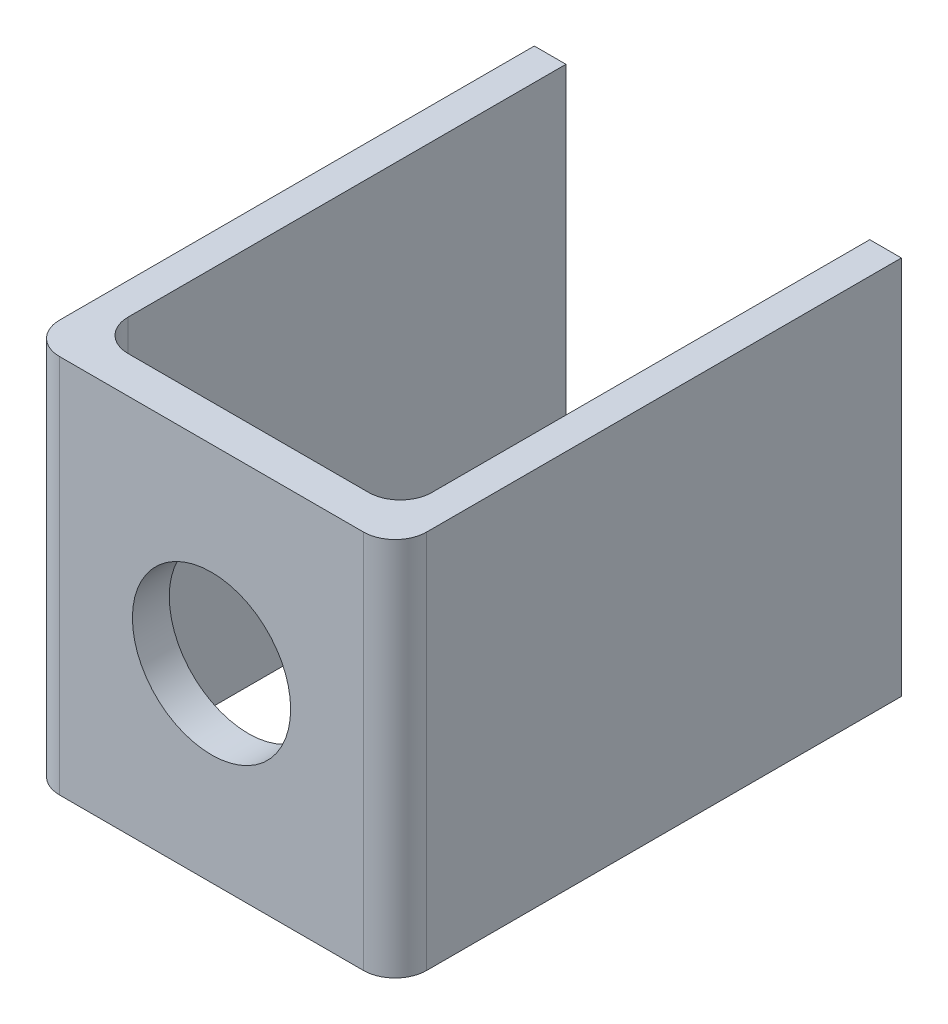
ISO-10303-21;
HEADER;
FILE_DESCRIPTION(('STEP AP214'),'2;1');
FILE_NAME('part.step','',(''),(''),'','','');
FILE_SCHEMA(('AUTOMOTIVE_DESIGN { 1 0 10303 214 1 1 1 1 }'));
ENDSEC;
DATA;
#1=APPLICATION_CONTEXT('core data for automotive mechanical design processes');
#2=APPLICATION_PROTOCOL_DEFINITION('international standard','automotive_design',2000,#1);
#3=PRODUCT_CONTEXT('',#1,'mechanical');
#4=PRODUCT('Part','Part','',(#3));
#5=PRODUCT_RELATED_PRODUCT_CATEGORY('part','',(#4));
#6=PRODUCT_DEFINITION_FORMATION('','',#4);
#7=PRODUCT_DEFINITION_CONTEXT('part definition',#1,'design');
#8=PRODUCT_DEFINITION('design','',#6,#7);
#9=PRODUCT_DEFINITION_SHAPE('','',#8);
#10=(LENGTH_UNIT() NAMED_UNIT(*) SI_UNIT(.MILLI.,.METRE.));
#11=(NAMED_UNIT(*) PLANE_ANGLE_UNIT() SI_UNIT($,.RADIAN.));
#12=(NAMED_UNIT(*) SI_UNIT($,.STERADIAN.) SOLID_ANGLE_UNIT());
#13=UNCERTAINTY_MEASURE_WITH_UNIT(LENGTH_MEASURE(1.E-05),#10,'distance_accuracy_value','');
#14=(GEOMETRIC_REPRESENTATION_CONTEXT(3) GLOBAL_UNCERTAINTY_ASSIGNED_CONTEXT((#13)) GLOBAL_UNIT_ASSIGNED_CONTEXT((#10,
#11,#12)) REPRESENTATION_CONTEXT('',''));
#15=CARTESIAN_POINT('',(0.,0.,0.));
#16=DIRECTION('',(0.,0.,1.));
#17=DIRECTION('',(1.,0.,0.));
#18=AXIS2_PLACEMENT_3D('',#15,#16,#17);
#19=CARTESIAN_POINT('',(0.,60.,-80.));
#20=DIRECTION('',(0.,0.,1.));
#21=DIRECTION('',(1.,0.,0.));
#22=AXIS2_PLACEMENT_3D('',#19,#20,#21);
#23=PLANE('',#22);
#24=DIRECTION('',(-1.,0.,0.));
#25=VECTOR('',#24,1.);
#26=CARTESIAN_POINT('',(0.,0.,-80.));
#27=LINE('',#26,#25);
#28=CARTESIAN_POINT('',(5.,0.,-80.));
#29=VERTEX_POINT('',#28);
#30=CARTESIAN_POINT('',(0.,0.,-80.));
#31=VERTEX_POINT('',#30);
#32=EDGE_CURVE('E157',#29,#31,#27,.T.);
#33=ORIENTED_EDGE('',*,*,#32,.T.);
#34=DIRECTION('',(0.,-1.,0.));
#35=VECTOR('',#34,1.);
#36=CARTESIAN_POINT('',(0.,60.,-80.));
#37=LINE('',#36,#35);
#38=CARTESIAN_POINT('',(0.,60.,-80.));
#39=VERTEX_POINT('',#38);
#40=EDGE_CURVE('E11',#39,#31,#37,.T.);
#41=ORIENTED_EDGE('',*,*,#40,.F.);
#42=DIRECTION('',(-1.,0.,0.));
#43=VECTOR('',#42,1.);
#44=CARTESIAN_POINT('',(0.,60.,-80.));
#45=LINE('',#44,#43);
#46=CARTESIAN_POINT('',(5.,60.,-80.));
#47=VERTEX_POINT('',#46);
#48=EDGE_CURVE('E179',#47,#39,#45,.T.);
#49=ORIENTED_EDGE('',*,*,#48,.F.);
#50=DIRECTION('',(0.,-1.,0.));
#51=VECTOR('',#50,1.);
#52=CARTESIAN_POINT('',(5.,60.,-80.));
#53=LINE('',#52,#51);
#54=EDGE_CURVE('E153',#47,#29,#53,.T.);
#55=ORIENTED_EDGE('',*,*,#54,.T.);
#56=EDGE_LOOP('',(#33,#41,#49,#55));
#57=FACE_BOUND('',#56,.T.);
#58=ADVANCED_FACE('F36',(#57),#23,.F.);
#59=CARTESIAN_POINT('',(0.,60.,-80.));
#60=DIRECTION('',(1.,0.,0.));
#61=DIRECTION('',(0.,0.,-1.));
#62=AXIS2_PLACEMENT_3D('',#59,#60,#61);
#63=PLANE('',#62);
#64=DIRECTION('',(0.,0.,1.));
#65=VECTOR('',#64,1.);
#66=CARTESIAN_POINT('',(0.,0.,-80.));
#67=LINE('',#66,#65);
#68=CARTESIAN_POINT('',(0.,0.,-5.00000000000004));
#69=VERTEX_POINT('',#68);
#70=EDGE_CURVE('E160',#31,#69,#67,.T.);
#71=ORIENTED_EDGE('',*,*,#70,.T.);
#72=DIRECTION('',(0.,-1.,0.));
#73=VECTOR('',#72,1.);
#74=CARTESIAN_POINT('',(0.,60.,-5.00000000000004));
#75=LINE('',#74,#73);
#76=CARTESIAN_POINT('',(0.,60.,-5.00000000000004));
#77=VERTEX_POINT('',#76);
#78=EDGE_CURVE('E45',#77,#69,#75,.T.);
#79=ORIENTED_EDGE('',*,*,#78,.F.);
#80=DIRECTION('',(0.,0.,1.));
#81=VECTOR('',#80,1.);
#82=CARTESIAN_POINT('',(0.,60.,-80.));
#83=LINE('',#82,#81);
#84=EDGE_CURVE('E108',#39,#77,#83,.T.);
#85=ORIENTED_EDGE('',*,*,#84,.F.);
#86=ORIENTED_EDGE('',*,*,#40,.T.);
#87=EDGE_LOOP('',(#71,#79,#85,#86));
#88=FACE_BOUND('',#87,.T.);
#89=ADVANCED_FACE('F258',(#88),#63,.F.);
#90=CARTESIAN_POINT('',(5.,60.,-5.));
#91=DIRECTION('',(0.,-1.,0.));
#92=DIRECTION('',(0.,0.,-1.));
#93=AXIS2_PLACEMENT_3D('',#90,#91,#92);
#94=CYLINDRICAL_SURFACE('',#93,5.);
#95=CARTESIAN_POINT('',(5.,0.,-5.));
#96=DIRECTION('',(0.,1.,0.));
#97=DIRECTION('',(0.,0.,1.));
#98=AXIS2_PLACEMENT_3D('',#95,#96,#97);
#99=CIRCLE('',#98,5.);
#100=CARTESIAN_POINT('',(5.,0.,0.));
#101=VERTEX_POINT('',#100);
#102=EDGE_CURVE('E162',#69,#101,#99,.T.);
#103=ORIENTED_EDGE('',*,*,#102,.T.);
#104=DIRECTION('',(0.,-1.,0.));
#105=VECTOR('',#104,1.);
#106=CARTESIAN_POINT('',(5.,60.,0.));
#107=LINE('',#106,#105);
#108=CARTESIAN_POINT('',(5.,60.,0.));
#109=VERTEX_POINT('',#108);
#110=EDGE_CURVE('E198',#109,#101,#107,.T.);
#111=ORIENTED_EDGE('',*,*,#110,.F.);
#112=CARTESIAN_POINT('',(5.,60.,-5.));
#113=DIRECTION('',(0.,1.,0.));
#114=DIRECTION('',(0.,0.,1.));
#115=AXIS2_PLACEMENT_3D('',#112,#113,#114);
#116=CIRCLE('',#115,5.);
#117=EDGE_CURVE('E207',#77,#109,#116,.T.);
#118=ORIENTED_EDGE('',*,*,#117,.F.);
#119=ORIENTED_EDGE('',*,*,#78,.T.);
#120=EDGE_LOOP('',(#103,#111,#118,#119));
#121=FACE_BOUND('',#120,.T.);
#122=ADVANCED_FACE('F205',(#121),#94,.T.);
#123=CARTESIAN_POINT('',(5.00000000000004,60.,0.));
#124=DIRECTION('',(0.,0.,-1.));
#125=DIRECTION('',(-1.,0.,0.));
#126=AXIS2_PLACEMENT_3D('',#123,#124,#125);
#127=PLANE('',#126);
#128=CARTESIAN_POINT('',(29.,30.,0.));
#129=DIRECTION('',(0.,0.,1.));
#130=DIRECTION('',(1.,0.,0.));
#131=AXIS2_PLACEMENT_3D('',#128,#129,#130);
#132=CIRCLE('',#131,12.5);
#133=CARTESIAN_POINT('',(41.5,30.,0.));
#134=VERTEX_POINT('',#133);
#135=EDGE_CURVE('E291',#134,#134,#132,.T.);
#136=ORIENTED_EDGE('',*,*,#135,.F.);
#137=EDGE_LOOP('',(#136));
#138=FACE_BOUND('',#137,.T.);
#139=DIRECTION('',(1.,0.,0.));
#140=VECTOR('',#139,1.);
#141=CARTESIAN_POINT('',(5.00000000000004,0.,0.));
#142=LINE('',#141,#140);
#143=CARTESIAN_POINT('',(53.,0.,0.));
#144=VERTEX_POINT('',#143);
#145=EDGE_CURVE('E164',#101,#144,#142,.T.);
#146=ORIENTED_EDGE('',*,*,#145,.T.);
#147=DIRECTION('',(0.,-1.,0.));
#148=VECTOR('',#147,1.);
#149=CARTESIAN_POINT('',(53.,60.,0.));
#150=LINE('',#149,#148);
#151=CARTESIAN_POINT('',(53.,60.,0.));
#152=VERTEX_POINT('',#151);
#153=EDGE_CURVE('E195',#152,#144,#150,.T.);
#154=ORIENTED_EDGE('',*,*,#153,.F.);
#155=DIRECTION('',(1.,0.,0.));
#156=VECTOR('',#155,1.);
#157=CARTESIAN_POINT('',(5.00000000000004,60.,0.));
#158=LINE('',#157,#156);
#159=EDGE_CURVE('E225',#109,#152,#158,.T.);
#160=ORIENTED_EDGE('',*,*,#159,.F.);
#161=ORIENTED_EDGE('',*,*,#110,.T.);
#162=EDGE_LOOP('',(#146,#154,#160,#161));
#163=FACE_BOUND('',#162,.T.);
#164=ADVANCED_FACE('F216',(#138,#163),#127,.F.);
#165=CARTESIAN_POINT('',(53.,60.,-5.));
#166=DIRECTION('',(0.,-1.,0.));
#167=DIRECTION('',(0.,0.,-1.));
#168=AXIS2_PLACEMENT_3D('',#165,#166,#167);
#169=CYLINDRICAL_SURFACE('',#168,5.);
#170=CARTESIAN_POINT('',(53.,0.,-5.));
#171=DIRECTION('',(0.,1.,0.));
#172=DIRECTION('',(0.,0.,1.));
#173=AXIS2_PLACEMENT_3D('',#170,#171,#172);
#174=CIRCLE('',#173,5.);
#175=CARTESIAN_POINT('',(58.,0.,-5.00000000000004));
#176=VERTEX_POINT('',#175);
#177=EDGE_CURVE('E166',#144,#176,#174,.T.);
#178=ORIENTED_EDGE('',*,*,#177,.T.);
#179=DIRECTION('',(0.,-1.,0.));
#180=VECTOR('',#179,1.);
#181=CARTESIAN_POINT('',(58.,60.,-5.00000000000004));
#182=LINE('',#181,#180);
#183=CARTESIAN_POINT('',(58.,60.,-5.00000000000004));
#184=VERTEX_POINT('',#183);
#185=EDGE_CURVE('E192',#184,#176,#182,.T.);
#186=ORIENTED_EDGE('',*,*,#185,.F.);
#187=CARTESIAN_POINT('',(53.,60.,-5.));
#188=DIRECTION('',(0.,1.,0.));
#189=DIRECTION('',(0.,0.,1.));
#190=AXIS2_PLACEMENT_3D('',#187,#188,#189);
#191=CIRCLE('',#190,5.);
#192=EDGE_CURVE('E222',#152,#184,#191,.T.);
#193=ORIENTED_EDGE('',*,*,#192,.F.);
#194=ORIENTED_EDGE('',*,*,#153,.T.);
#195=EDGE_LOOP('',(#178,#186,#193,#194));
#196=FACE_BOUND('',#195,.T.);
#197=ADVANCED_FACE('F220',(#196),#169,.T.);
#198=CARTESIAN_POINT('',(58.,60.,-5.00000000000004));
#199=DIRECTION('',(-1.,0.,0.));
#200=DIRECTION('',(0.,0.,1.));
#201=AXIS2_PLACEMENT_3D('',#198,#199,#200);
#202=PLANE('',#201);
#203=DIRECTION('',(0.,0.,-1.));
#204=VECTOR('',#203,1.);
#205=CARTESIAN_POINT('',(58.,0.,-5.00000000000004));
#206=LINE('',#205,#204);
#207=CARTESIAN_POINT('',(58.,0.,-80.));
#208=VERTEX_POINT('',#207);
#209=EDGE_CURVE('E168',#176,#208,#206,.T.);
#210=ORIENTED_EDGE('',*,*,#209,.T.);
#211=DIRECTION('',(0.,-1.,0.));
#212=VECTOR('',#211,1.);
#213=CARTESIAN_POINT('',(58.,60.,-80.));
#214=LINE('',#213,#212);
#215=CARTESIAN_POINT('',(58.,60.,-80.));
#216=VERTEX_POINT('',#215);
#217=EDGE_CURVE('E189',#216,#208,#214,.T.);
#218=ORIENTED_EDGE('',*,*,#217,.F.);
#219=DIRECTION('',(0.,0.,-1.));
#220=VECTOR('',#219,1.);
#221=CARTESIAN_POINT('',(58.,60.,-5.00000000000004));
#222=LINE('',#221,#220);
#223=EDGE_CURVE('E224',#184,#216,#222,.T.);
#224=ORIENTED_EDGE('',*,*,#223,.F.);
#225=ORIENTED_EDGE('',*,*,#185,.T.);
#226=EDGE_LOOP('',(#210,#218,#224,#225));
#227=FACE_BOUND('',#226,.T.);
#228=ADVANCED_FACE('F272',(#227),#202,.F.);
#229=CARTESIAN_POINT('',(53.,60.,-80.));
#230=DIRECTION('',(0.,0.,1.));
#231=DIRECTION('',(1.,0.,0.));
#232=AXIS2_PLACEMENT_3D('',#229,#230,#231);
#233=PLANE('',#232);
#234=DIRECTION('',(-1.,0.,0.));
#235=VECTOR('',#234,1.);
#236=CARTESIAN_POINT('',(53.,0.,-80.));
#237=LINE('',#236,#235);
#238=CARTESIAN_POINT('',(53.,0.,-80.));
#239=VERTEX_POINT('',#238);
#240=EDGE_CURVE('E170',#208,#239,#237,.T.);
#241=ORIENTED_EDGE('',*,*,#240,.T.);
#242=DIRECTION('',(0.,-1.,0.));
#243=VECTOR('',#242,1.);
#244=CARTESIAN_POINT('',(53.,60.,-80.));
#245=LINE('',#244,#243);
#246=CARTESIAN_POINT('',(53.,60.,-80.));
#247=VERTEX_POINT('',#246);
#248=EDGE_CURVE('E186',#247,#239,#245,.T.);
#249=ORIENTED_EDGE('',*,*,#248,.F.);
#250=DIRECTION('',(-1.,0.,0.));
#251=VECTOR('',#250,1.);
#252=CARTESIAN_POINT('',(53.,60.,-80.));
#253=LINE('',#252,#251);
#254=EDGE_CURVE('E227',#216,#247,#253,.T.);
#255=ORIENTED_EDGE('',*,*,#254,.F.);
#256=ORIENTED_EDGE('',*,*,#217,.T.);
#257=EDGE_LOOP('',(#241,#249,#255,#256));
#258=FACE_BOUND('',#257,.T.);
#259=ADVANCED_FACE('F275',(#258),#233,.F.);
#260=CARTESIAN_POINT('',(53.,60.,-10.8221577352935));
#261=DIRECTION('',(1.,0.,0.));
#262=DIRECTION('',(0.,0.,-1.));
#263=AXIS2_PLACEMENT_3D('',#260,#261,#262);
#264=PLANE('',#263);
#265=DIRECTION('',(0.,0.,1.));
#266=VECTOR('',#265,1.);
#267=CARTESIAN_POINT('',(53.,0.,-10.8221577352935));
#268=LINE('',#267,#266);
#269=CARTESIAN_POINT('',(53.,0.,-10.8221577352935));
#270=VERTEX_POINT('',#269);
#271=EDGE_CURVE('E172',#239,#270,#268,.T.);
#272=ORIENTED_EDGE('',*,*,#271,.T.);
#273=DIRECTION('',(0.,-1.,0.));
#274=VECTOR('',#273,1.);
#275=CARTESIAN_POINT('',(53.,60.,-10.8221577352935));
#276=LINE('',#275,#274);
#277=CARTESIAN_POINT('',(53.,60.,-10.8221577352935));
#278=VERTEX_POINT('',#277);
#279=EDGE_CURVE('E183',#278,#270,#276,.T.);
#280=ORIENTED_EDGE('',*,*,#279,.F.);
#281=DIRECTION('',(0.,0.,1.));
#282=VECTOR('',#281,1.);
#283=CARTESIAN_POINT('',(53.,60.,-10.8221577352935));
#284=LINE('',#283,#282);
#285=EDGE_CURVE('E233',#247,#278,#284,.T.);
#286=ORIENTED_EDGE('',*,*,#285,.F.);
#287=ORIENTED_EDGE('',*,*,#248,.T.);
#288=EDGE_LOOP('',(#272,#280,#286,#287));
#289=FACE_BOUND('',#288,.T.);
#290=ADVANCED_FACE('F239',(#289),#264,.F.);
#291=CARTESIAN_POINT('',(48.,60.,-10.8221577352935));
#292=DIRECTION('',(0.,-1.,0.));
#293=DIRECTION('',(0.,0.,-1.));
#294=AXIS2_PLACEMENT_3D('',#291,#292,#293);
#295=CYLINDRICAL_SURFACE('',#294,5.);
#296=CARTESIAN_POINT('',(48.,0.,-10.8221577352935));
#297=DIRECTION('',(0.,-1.,0.));
#298=DIRECTION('',(0.,0.,1.));
#299=AXIS2_PLACEMENT_3D('',#296,#297,#298);
#300=CIRCLE('',#299,5.);
#301=CARTESIAN_POINT('',(48.,0.,-5.82215773529349));
#302=VERTEX_POINT('',#301);
#303=EDGE_CURVE('E174',#270,#302,#300,.T.);
#304=ORIENTED_EDGE('',*,*,#303,.T.);
#305=DIRECTION('',(0.,-1.,0.));
#306=VECTOR('',#305,1.);
#307=CARTESIAN_POINT('',(48.,60.,-5.82215773529349));
#308=LINE('',#307,#306);
#309=CARTESIAN_POINT('',(48.,60.,-5.82215773529349));
#310=VERTEX_POINT('',#309);
#311=EDGE_CURVE('E148',#310,#302,#308,.T.);
#312=ORIENTED_EDGE('',*,*,#311,.F.);
#313=CARTESIAN_POINT('',(48.,60.,-10.8221577352935));
#314=DIRECTION('',(0.,-1.,0.));
#315=DIRECTION('',(0.,0.,1.));
#316=AXIS2_PLACEMENT_3D('',#313,#314,#315);
#317=CIRCLE('',#316,5.);
#318=EDGE_CURVE('E139',#278,#310,#317,.T.);
#319=ORIENTED_EDGE('',*,*,#318,.F.);
#320=ORIENTED_EDGE('',*,*,#279,.T.);
#321=EDGE_LOOP('',(#304,#312,#319,#320));
#322=FACE_BOUND('',#321,.T.);
#323=ADVANCED_FACE('F243',(#322),#295,.F.);
#324=CARTESIAN_POINT('',(10.,60.,-5.82215773529349));
#325=DIRECTION('',(0.,0.,1.));
#326=DIRECTION('',(1.,0.,0.));
#327=AXIS2_PLACEMENT_3D('',#324,#325,#326);
#328=PLANE('',#327);
#329=CARTESIAN_POINT('',(29.,30.,-5.82215773529349));
#330=DIRECTION('',(0.,0.,1.));
#331=DIRECTION('',(1.,0.,0.));
#332=AXIS2_PLACEMENT_3D('',#329,#330,#331);
#333=CIRCLE('',#332,12.5);
#334=CARTESIAN_POINT('',(41.5,30.,-5.82215773529349));
#335=VERTEX_POINT('',#334);
#336=EDGE_CURVE('E39',#335,#335,#333,.T.);
#337=ORIENTED_EDGE('',*,*,#336,.T.);
#338=EDGE_LOOP('',(#337));
#339=FACE_BOUND('',#338,.T.);
#340=DIRECTION('',(-1.,0.,0.));
#341=VECTOR('',#340,1.);
#342=CARTESIAN_POINT('',(10.,0.,-5.82215773529349));
#343=LINE('',#342,#341);
#344=CARTESIAN_POINT('',(10.,0.,-5.82215773529349));
#345=VERTEX_POINT('',#344);
#346=EDGE_CURVE('E147',#302,#345,#343,.T.);
#347=ORIENTED_EDGE('',*,*,#346,.T.);
#348=DIRECTION('',(0.,-1.,0.));
#349=VECTOR('',#348,1.);
#350=CARTESIAN_POINT('',(10.,60.,-5.82215773529349));
#351=LINE('',#350,#349);
#352=CARTESIAN_POINT('',(10.,60.,-5.82215773529349));
#353=VERTEX_POINT('',#352);
#354=EDGE_CURVE('E144',#353,#345,#351,.T.);
#355=ORIENTED_EDGE('',*,*,#354,.F.);
#356=DIRECTION('',(-1.,0.,0.));
#357=VECTOR('',#356,1.);
#358=CARTESIAN_POINT('',(10.,60.,-5.82215773529349));
#359=LINE('',#358,#357);
#360=EDGE_CURVE('E133',#310,#353,#359,.T.);
#361=ORIENTED_EDGE('',*,*,#360,.F.);
#362=ORIENTED_EDGE('',*,*,#311,.T.);
#363=EDGE_LOOP('',(#347,#355,#361,#362));
#364=FACE_BOUND('',#363,.T.);
#365=ADVANCED_FACE('F145',(#339,#364),#328,.F.);
#366=CARTESIAN_POINT('',(10.,60.,-10.8221577352935));
#367=DIRECTION('',(0.,-1.,0.));
#368=DIRECTION('',(0.,0.,-1.));
#369=AXIS2_PLACEMENT_3D('',#366,#367,#368);
#370=CYLINDRICAL_SURFACE('',#369,5.);
#371=CARTESIAN_POINT('',(10.,0.,-10.8221577352935));
#372=DIRECTION('',(0.,-1.,0.));
#373=DIRECTION('',(0.,0.,1.));
#374=AXIS2_PLACEMENT_3D('',#371,#372,#373);
#375=CIRCLE('',#374,5.);
#376=CARTESIAN_POINT('',(5.00000000000001,0.,-10.8221577352935));
#377=VERTEX_POINT('',#376);
#378=EDGE_CURVE('E94',#345,#377,#375,.T.);
#379=ORIENTED_EDGE('',*,*,#378,.T.);
#380=DIRECTION('',(0.,-1.,0.));
#381=VECTOR('',#380,1.);
#382=CARTESIAN_POINT('',(5.00000000000001,60.,-10.8221577352935));
#383=LINE('',#382,#381);
#384=CARTESIAN_POINT('',(5.00000000000001,60.,-10.8221577352935));
#385=VERTEX_POINT('',#384);
#386=EDGE_CURVE('E149',#385,#377,#383,.T.);
#387=ORIENTED_EDGE('',*,*,#386,.F.);
#388=CARTESIAN_POINT('',(10.,60.,-10.8221577352935));
#389=DIRECTION('',(0.,-1.,0.));
#390=DIRECTION('',(0.,0.,1.));
#391=AXIS2_PLACEMENT_3D('',#388,#389,#390);
#392=CIRCLE('',#391,5.);
#393=EDGE_CURVE('E137',#353,#385,#392,.T.);
#394=ORIENTED_EDGE('',*,*,#393,.F.);
#395=ORIENTED_EDGE('',*,*,#354,.T.);
#396=EDGE_LOOP('',(#379,#387,#394,#395));
#397=FACE_BOUND('',#396,.T.);
#398=ADVANCED_FACE('F151',(#397),#370,.F.);
#399=CARTESIAN_POINT('',(5.,60.,-80.));
#400=DIRECTION('',(-1.,0.,0.));
#401=DIRECTION('',(0.,0.,1.));
#402=AXIS2_PLACEMENT_3D('',#399,#400,#401);
#403=PLANE('',#402);
#404=DIRECTION('',(0.,0.,-1.));
#405=VECTOR('',#404,1.);
#406=CARTESIAN_POINT('',(5.,0.,-80.));
#407=LINE('',#406,#405);
#408=EDGE_CURVE('E100',#377,#29,#407,.T.);
#409=ORIENTED_EDGE('',*,*,#408,.T.);
#410=ORIENTED_EDGE('',*,*,#54,.F.);
#411=DIRECTION('',(0.,0.,-1.));
#412=VECTOR('',#411,1.);
#413=CARTESIAN_POINT('',(5.,60.,-80.));
#414=LINE('',#413,#412);
#415=EDGE_CURVE('E53',#385,#47,#414,.T.);
#416=ORIENTED_EDGE('',*,*,#415,.F.);
#417=ORIENTED_EDGE('',*,*,#386,.T.);
#418=EDGE_LOOP('',(#409,#410,#416,#417));
#419=FACE_BOUND('',#418,.T.);
#420=ADVANCED_FACE('F247',(#419),#403,.F.);
#421=CARTESIAN_POINT('',(10.,60.,-10.8221577352935));
#422=DIRECTION('',(0.,1.,0.));
#423=DIRECTION('',(0.,0.,1.));
#424=AXIS2_PLACEMENT_3D('',#421,#422,#423);
#425=PLANE('',#424);
#426=ORIENTED_EDGE('',*,*,#48,.T.);
#427=ORIENTED_EDGE('',*,*,#84,.T.);
#428=ORIENTED_EDGE('',*,*,#117,.T.);
#429=ORIENTED_EDGE('',*,*,#159,.T.);
#430=ORIENTED_EDGE('',*,*,#192,.T.);
#431=ORIENTED_EDGE('',*,*,#223,.T.);
#432=ORIENTED_EDGE('',*,*,#254,.T.);
#433=ORIENTED_EDGE('',*,*,#285,.T.);
#434=ORIENTED_EDGE('',*,*,#318,.T.);
#435=ORIENTED_EDGE('',*,*,#360,.T.);
#436=ORIENTED_EDGE('',*,*,#393,.T.);
#437=ORIENTED_EDGE('',*,*,#415,.T.);
#438=EDGE_LOOP('',(#426,#427,#428,#429,#430,#431,#432,#433,#434,#435,#436,#437));
#439=FACE_BOUND('',#438,.T.);
#440=ADVANCED_FACE('F135',(#439),#425,.T.);
#441=CARTESIAN_POINT('',(10.,0.,-10.8221577352935));
#442=DIRECTION('',(0.,1.,0.));
#443=DIRECTION('',(0.,0.,1.));
#444=AXIS2_PLACEMENT_3D('',#441,#442,#443);
#445=PLANE('',#444);
#446=ORIENTED_EDGE('',*,*,#32,.F.);
#447=ORIENTED_EDGE('',*,*,#408,.F.);
#448=ORIENTED_EDGE('',*,*,#378,.F.);
#449=ORIENTED_EDGE('',*,*,#346,.F.);
#450=ORIENTED_EDGE('',*,*,#303,.F.);
#451=ORIENTED_EDGE('',*,*,#271,.F.);
#452=ORIENTED_EDGE('',*,*,#240,.F.);
#453=ORIENTED_EDGE('',*,*,#209,.F.);
#454=ORIENTED_EDGE('',*,*,#177,.F.);
#455=ORIENTED_EDGE('',*,*,#145,.F.);
#456=ORIENTED_EDGE('',*,*,#102,.F.);
#457=ORIENTED_EDGE('',*,*,#70,.F.);
#458=EDGE_LOOP('',(#446,#447,#448,#449,#450,#451,#452,#453,#454,#455,#456,#457));
#459=FACE_BOUND('',#458,.T.);
#460=ADVANCED_FACE('F211',(#459),#445,.F.);
#461=CARTESIAN_POINT('',(29.,30.,-80.));
#462=DIRECTION('',(0.,0.,1.));
#463=DIRECTION('',(1.,0.,0.));
#464=AXIS2_PLACEMENT_3D('',#461,#462,#463);
#465=CYLINDRICAL_SURFACE('',#464,12.5);
#466=ORIENTED_EDGE('',*,*,#135,.T.);
#467=EDGE_LOOP('',(#466));
#468=FACE_BOUND('',#467,.T.);
#469=ORIENTED_EDGE('',*,*,#336,.F.);
#470=EDGE_LOOP('',(#469));
#471=FACE_BOUND('',#470,.T.);
#472=ADVANCED_FACE('F298',(#468,#471),#465,.F.);
#473=CLOSED_SHELL('',(#58,#89,#122,#164,#197,#228,#259,#290,#323,#365,#398,#420,#440,#460,#472));
#474=MANIFOLD_SOLID_BREP('B2',#473);
#475=ADVANCED_BREP_SHAPE_REPRESENTATION('',(#18,#474),#14);
#476=SHAPE_DEFINITION_REPRESENTATION(#9,#475);
ENDSEC;
END-ISO-10303-21;
